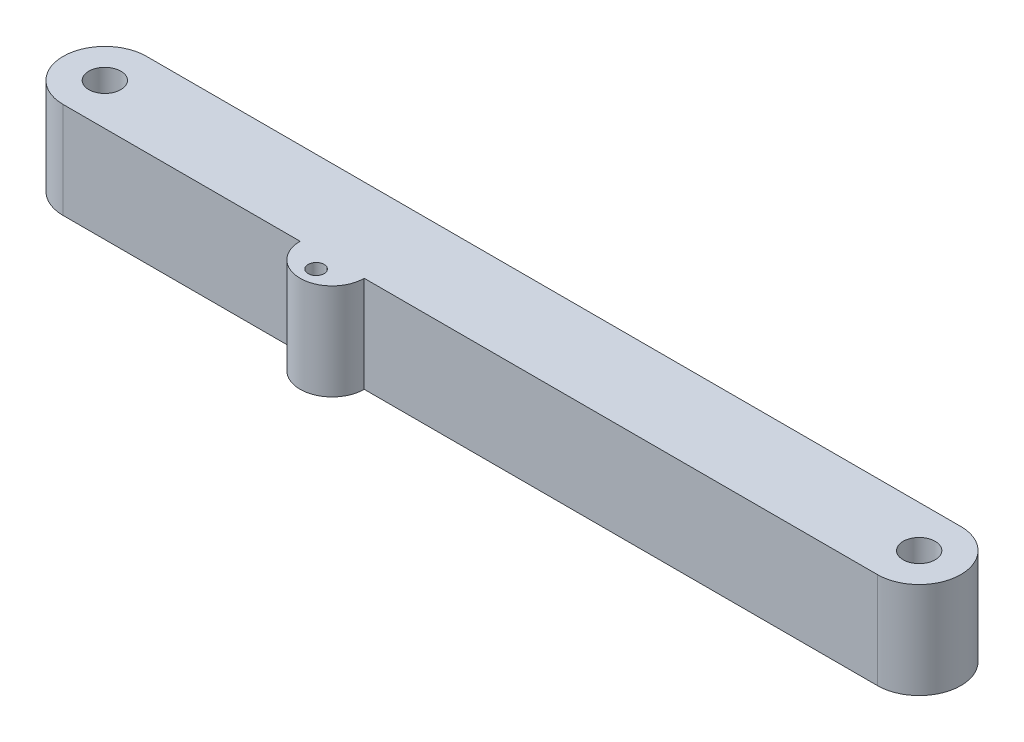
ISO-10303-21;
HEADER;
FILE_DESCRIPTION(('STEP AP214'),'2;1');
FILE_NAME('part.step','',(''),(''),'','','');
FILE_SCHEMA(('AUTOMOTIVE_DESIGN { 1 0 10303 214 1 1 1 1 }'));
ENDSEC;
DATA;
#1=APPLICATION_CONTEXT('core data for automotive mechanical design processes');
#2=APPLICATION_PROTOCOL_DEFINITION('international standard','automotive_design',2000,#1);
#3=PRODUCT_CONTEXT('',#1,'mechanical');
#4=PRODUCT('Part','Part','',(#3));
#5=PRODUCT_RELATED_PRODUCT_CATEGORY('part','',(#4));
#6=PRODUCT_DEFINITION_FORMATION('','',#4);
#7=PRODUCT_DEFINITION_CONTEXT('part definition',#1,'design');
#8=PRODUCT_DEFINITION('design','',#6,#7);
#9=PRODUCT_DEFINITION_SHAPE('','',#8);
#10=(LENGTH_UNIT() NAMED_UNIT(*) SI_UNIT(.MILLI.,.METRE.));
#11=(NAMED_UNIT(*) PLANE_ANGLE_UNIT() SI_UNIT($,.RADIAN.));
#12=(NAMED_UNIT(*) SI_UNIT($,.STERADIAN.) SOLID_ANGLE_UNIT());
#13=UNCERTAINTY_MEASURE_WITH_UNIT(LENGTH_MEASURE(1.E-05),#10,'distance_accuracy_value','');
#14=(GEOMETRIC_REPRESENTATION_CONTEXT(3) GLOBAL_UNCERTAINTY_ASSIGNED_CONTEXT((#13)) GLOBAL_UNIT_ASSIGNED_CONTEXT((#10,
#11,#12)) REPRESENTATION_CONTEXT('',''));
#15=CARTESIAN_POINT('',(0.,0.,0.));
#16=DIRECTION('',(0.,0.,1.));
#17=DIRECTION('',(1.,0.,0.));
#18=AXIS2_PLACEMENT_3D('',#15,#16,#17);
#19=CARTESIAN_POINT('',(-80.645,19.05,8.255));
#20=DIRECTION('',(0.,0.,-1.));
#21=DIRECTION('',(-1.,0.,0.));
#22=AXIS2_PLACEMENT_3D('',#19,#20,#21);
#23=PLANE('',#22);
#24=DIRECTION('',(1.,0.,0.));
#25=VECTOR('',#24,1.);
#26=CARTESIAN_POINT('',(-80.645,0.,8.255));
#27=LINE('',#26,#25);
#28=CARTESIAN_POINT('',(-80.645,0.,8.255));
#29=VERTEX_POINT('',#28);
#30=CARTESIAN_POINT('',(-33.713899298,0.,8.255));
#31=VERTEX_POINT('',#30);
#32=EDGE_CURVE('E97',#29,#31,#27,.T.);
#33=ORIENTED_EDGE('',*,*,#32,.T.);
#34=DIRECTION('',(0.,1.,0.));
#35=VECTOR('',#34,1.);
#36=CARTESIAN_POINT('',(-33.713899298,-14.1990316571237,8.255));
#37=LINE('',#36,#35);
#38=CARTESIAN_POINT('',(-33.713899298,19.05,8.255));
#39=VERTEX_POINT('',#38);
#40=EDGE_CURVE('E57',#31,#39,#37,.T.);
#41=ORIENTED_EDGE('',*,*,#40,.T.);
#42=DIRECTION('',(1.,0.,0.));
#43=VECTOR('',#42,1.);
#44=CARTESIAN_POINT('',(-80.645,19.05,8.255));
#45=LINE('',#44,#43);
#46=CARTESIAN_POINT('',(-80.645,19.05,8.255));
#47=VERTEX_POINT('',#46);
#48=EDGE_CURVE('E134',#47,#39,#45,.T.);
#49=ORIENTED_EDGE('',*,*,#48,.F.);
#50=DIRECTION('',(0.,-1.,0.));
#51=VECTOR('',#50,1.);
#52=CARTESIAN_POINT('',(-80.645,19.05,8.255));
#53=LINE('',#52,#51);
#54=EDGE_CURVE('E11',#47,#29,#53,.T.);
#55=ORIENTED_EDGE('',*,*,#54,.T.);
#56=EDGE_LOOP('',(#33,#41,#49,#55));
#57=FACE_BOUND('',#56,.T.);
#58=ADVANCED_FACE('F34',(#57),#23,.F.);
#59=CARTESIAN_POINT('',(-80.645,19.05,0.));
#60=DIRECTION('',(0.,1.,0.));
#61=DIRECTION('',(0.,0.,1.));
#62=AXIS2_PLACEMENT_3D('',#59,#60,#61);
#63=PLANE('',#62);
#64=CARTESIAN_POINT('',(-80.645,19.05,0.));
#65=DIRECTION('',(0.,1.,0.));
#66=DIRECTION('',(0.,0.,1.));
#67=AXIS2_PLACEMENT_3D('',#64,#65,#66);
#68=CIRCLE('',#67,3.175);
#69=CARTESIAN_POINT('',(-80.645,19.05,3.175));
#70=VERTEX_POINT('',#69);
#71=EDGE_CURVE('E125',#70,#70,#68,.T.);
#72=ORIENTED_EDGE('',*,*,#71,.F.);
#73=EDGE_LOOP('',(#72));
#74=FACE_BOUND('',#73,.T.);
#75=CARTESIAN_POINT('',(-80.645,19.05,0.));
#76=DIRECTION('',(0.,1.,0.));
#77=DIRECTION('',(0.,0.,1.));
#78=AXIS2_PLACEMENT_3D('',#75,#76,#77);
#79=CIRCLE('',#78,8.255);
#80=CARTESIAN_POINT('',(-80.645,19.05,-8.255));
#81=VERTEX_POINT('',#80);
#82=EDGE_CURVE('E130',#81,#47,#79,.T.);
#83=ORIENTED_EDGE('',*,*,#82,.T.);
#84=ORIENTED_EDGE('',*,*,#48,.T.);
#85=CARTESIAN_POINT('',(-27.363899298,19.05,8.255));
#86=DIRECTION('',(0.,1.,0.));
#87=DIRECTION('',(0.,0.,1.));
#88=AXIS2_PLACEMENT_3D('',#85,#86,#87);
#89=CIRCLE('',#88,6.35);
#90=CARTESIAN_POINT('',(-21.013899298,19.05,8.255));
#91=VERTEX_POINT('',#90);
#92=EDGE_CURVE('E105',#39,#91,#89,.T.);
#93=ORIENTED_EDGE('',*,*,#92,.T.);
#94=CARTESIAN_POINT('',(80.645,19.05,8.255));
#95=VERTEX_POINT('',#94);
#96=EDGE_CURVE('E49',#91,#95,#45,.T.);
#97=ORIENTED_EDGE('',*,*,#96,.T.);
#98=CARTESIAN_POINT('',(80.645,19.05,0.));
#99=DIRECTION('',(0.,1.,0.));
#100=DIRECTION('',(0.,0.,-1.));
#101=AXIS2_PLACEMENT_3D('',#98,#99,#100);
#102=CIRCLE('',#101,8.255);
#103=CARTESIAN_POINT('',(80.645,19.05,-8.255));
#104=VERTEX_POINT('',#103);
#105=EDGE_CURVE('E136',#95,#104,#102,.T.);
#106=ORIENTED_EDGE('',*,*,#105,.T.);
#107=DIRECTION('',(-1.,0.,0.));
#108=VECTOR('',#107,1.);
#109=CARTESIAN_POINT('',(-80.645,19.05,-8.255));
#110=LINE('',#109,#108);
#111=EDGE_CURVE('E138',#104,#81,#110,.T.);
#112=ORIENTED_EDGE('',*,*,#111,.T.);
#113=EDGE_LOOP('',(#83,#84,#93,#97,#106,#112));
#114=FACE_BOUND('',#113,.T.);
#115=CARTESIAN_POINT('',(80.645,19.05,0.));
#116=DIRECTION('',(0.,1.,0.));
#117=DIRECTION('',(0.,0.,1.));
#118=AXIS2_PLACEMENT_3D('',#115,#116,#117);
#119=CIRCLE('',#118,3.175);
#120=CARTESIAN_POINT('',(80.645,19.05,3.175));
#121=VERTEX_POINT('',#120);
#122=EDGE_CURVE('E119',#121,#121,#119,.T.);
#123=ORIENTED_EDGE('',*,*,#122,.F.);
#124=EDGE_LOOP('',(#123));
#125=FACE_BOUND('',#124,.T.);
#126=CARTESIAN_POINT('',(-27.363899298,19.05,11.43));
#127=DIRECTION('',(0.,1.,0.));
#128=DIRECTION('',(0.,0.,1.));
#129=AXIS2_PLACEMENT_3D('',#126,#127,#128);
#130=CIRCLE('',#129,1.5875);
#131=CARTESIAN_POINT('',(-27.363899298,19.05,13.0175));
#132=VERTEX_POINT('',#131);
#133=EDGE_CURVE('E115',#132,#132,#130,.T.);
#134=ORIENTED_EDGE('',*,*,#133,.F.);
#135=EDGE_LOOP('',(#134));
#136=FACE_BOUND('',#135,.T.);
#137=ADVANCED_FACE('F155',(#74,#114,#125,#136),#63,.T.);
#138=CARTESIAN_POINT('',(-80.645,0.,0.));
#139=DIRECTION('',(0.,1.,0.));
#140=DIRECTION('',(0.,0.,1.));
#141=AXIS2_PLACEMENT_3D('',#138,#139,#140);
#142=PLANE('',#141);
#143=CARTESIAN_POINT('',(-80.645,0.,0.));
#144=DIRECTION('',(0.,1.,0.));
#145=DIRECTION('',(0.,0.,1.));
#146=AXIS2_PLACEMENT_3D('',#143,#144,#145);
#147=CIRCLE('',#146,8.255);
#148=CARTESIAN_POINT('',(-80.645,0.,-8.255));
#149=VERTEX_POINT('',#148);
#150=EDGE_CURVE('E98',#149,#29,#147,.T.);
#151=ORIENTED_EDGE('',*,*,#150,.F.);
#152=DIRECTION('',(-1.,0.,0.));
#153=VECTOR('',#152,1.);
#154=CARTESIAN_POINT('',(-80.645,0.,-8.255));
#155=LINE('',#154,#153);
#156=CARTESIAN_POINT('',(80.645,0.,-8.255));
#157=VERTEX_POINT('',#156);
#158=EDGE_CURVE('E133',#157,#149,#155,.T.);
#159=ORIENTED_EDGE('',*,*,#158,.F.);
#160=CARTESIAN_POINT('',(80.645,0.,0.));
#161=DIRECTION('',(0.,1.,0.));
#162=DIRECTION('',(0.,0.,-1.));
#163=AXIS2_PLACEMENT_3D('',#160,#161,#162);
#164=CIRCLE('',#163,8.255);
#165=CARTESIAN_POINT('',(80.645,0.,8.255));
#166=VERTEX_POINT('',#165);
#167=EDGE_CURVE('E95',#166,#157,#164,.T.);
#168=ORIENTED_EDGE('',*,*,#167,.F.);
#169=CARTESIAN_POINT('',(-21.013899298,0.,8.255));
#170=VERTEX_POINT('',#169);
#171=EDGE_CURVE('E88',#170,#166,#27,.T.);
#172=ORIENTED_EDGE('',*,*,#171,.F.);
#173=CARTESIAN_POINT('',(-27.363899298,0.,8.255));
#174=DIRECTION('',(0.,1.,0.));
#175=DIRECTION('',(0.,0.,1.));
#176=AXIS2_PLACEMENT_3D('',#173,#174,#175);
#177=CIRCLE('',#176,6.35);
#178=EDGE_CURVE('E93',#170,#31,#177,.F.);
#179=ORIENTED_EDGE('',*,*,#178,.T.);
#180=ORIENTED_EDGE('',*,*,#32,.F.);
#181=EDGE_LOOP('',(#151,#159,#168,#172,#179,#180));
#182=FACE_BOUND('',#181,.T.);
#183=CARTESIAN_POINT('',(-80.645,0.,0.));
#184=DIRECTION('',(0.,1.,0.));
#185=DIRECTION('',(0.,0.,1.));
#186=AXIS2_PLACEMENT_3D('',#183,#184,#185);
#187=CIRCLE('',#186,3.175);
#188=CARTESIAN_POINT('',(-80.645,0.,3.175));
#189=VERTEX_POINT('',#188);
#190=EDGE_CURVE('E122',#189,#189,#187,.T.);
#191=ORIENTED_EDGE('',*,*,#190,.T.);
#192=EDGE_LOOP('',(#191));
#193=FACE_BOUND('',#192,.T.);
#194=CARTESIAN_POINT('',(80.645,0.,0.));
#195=DIRECTION('',(0.,1.,0.));
#196=DIRECTION('',(0.,0.,1.));
#197=AXIS2_PLACEMENT_3D('',#194,#195,#196);
#198=CIRCLE('',#197,3.175);
#199=CARTESIAN_POINT('',(80.645,0.,3.175));
#200=VERTEX_POINT('',#199);
#201=EDGE_CURVE('E111',#200,#200,#198,.T.);
#202=ORIENTED_EDGE('',*,*,#201,.T.);
#203=EDGE_LOOP('',(#202));
#204=FACE_BOUND('',#203,.T.);
#205=CARTESIAN_POINT('',(-27.363899298,0.,11.43));
#206=DIRECTION('',(0.,1.,0.));
#207=DIRECTION('',(0.,0.,1.));
#208=AXIS2_PLACEMENT_3D('',#205,#206,#207);
#209=CIRCLE('',#208,1.5875);
#210=CARTESIAN_POINT('',(-27.363899298,0.,13.0175));
#211=VERTEX_POINT('',#210);
#212=EDGE_CURVE('E108',#211,#211,#209,.F.);
#213=ORIENTED_EDGE('',*,*,#212,.F.);
#214=EDGE_LOOP('',(#213));
#215=FACE_BOUND('',#214,.T.);
#216=ADVANCED_FACE('F90',(#182,#193,#204,#215),#142,.F.);
#217=CARTESIAN_POINT('',(-80.645,19.05,0.));
#218=DIRECTION('',(0.,-1.,0.));
#219=DIRECTION('',(0.,0.,-1.));
#220=AXIS2_PLACEMENT_3D('',#217,#218,#219);
#221=CYLINDRICAL_SURFACE('',#220,8.255);
#222=ORIENTED_EDGE('',*,*,#150,.T.);
#223=ORIENTED_EDGE('',*,*,#54,.F.);
#224=ORIENTED_EDGE('',*,*,#82,.F.);
#225=DIRECTION('',(0.,-1.,0.));
#226=VECTOR('',#225,1.);
#227=CARTESIAN_POINT('',(-80.645,19.05,-8.255));
#228=LINE('',#227,#226);
#229=EDGE_CURVE('E140',#81,#149,#228,.T.);
#230=ORIENTED_EDGE('',*,*,#229,.T.);
#231=EDGE_LOOP('',(#222,#223,#224,#230));
#232=FACE_BOUND('',#231,.T.);
#233=ADVANCED_FACE('F36',(#232),#221,.T.);
#234=ORIENTED_EDGE('',*,*,#96,.F.);
#235=DIRECTION('',(0.,1.,0.));
#236=VECTOR('',#235,1.);
#237=CARTESIAN_POINT('',(-21.013899298,-14.1990316571237,8.255));
#238=LINE('',#237,#236);
#239=EDGE_CURVE('E100',#170,#91,#238,.T.);
#240=ORIENTED_EDGE('',*,*,#239,.F.);
#241=ORIENTED_EDGE('',*,*,#171,.T.);
#242=DIRECTION('',(0.,-1.,0.));
#243=VECTOR('',#242,1.);
#244=CARTESIAN_POINT('',(80.645,19.05,8.255));
#245=LINE('',#244,#243);
#246=EDGE_CURVE('E42',#95,#166,#245,.T.);
#247=ORIENTED_EDGE('',*,*,#246,.F.);
#248=EDGE_LOOP('',(#234,#240,#241,#247));
#249=FACE_BOUND('',#248,.T.);
#250=ADVANCED_FACE('F101',(#249),#23,.F.);
#251=CARTESIAN_POINT('',(80.645,19.05,0.));
#252=DIRECTION('',(0.,-1.,0.));
#253=DIRECTION('',(0.,0.,-1.));
#254=AXIS2_PLACEMENT_3D('',#251,#252,#253);
#255=CYLINDRICAL_SURFACE('',#254,8.255);
#256=ORIENTED_EDGE('',*,*,#167,.T.);
#257=DIRECTION('',(0.,-1.,0.));
#258=VECTOR('',#257,1.);
#259=CARTESIAN_POINT('',(80.645,19.05,-8.255));
#260=LINE('',#259,#258);
#261=EDGE_CURVE('E147',#104,#157,#260,.T.);
#262=ORIENTED_EDGE('',*,*,#261,.F.);
#263=ORIENTED_EDGE('',*,*,#105,.F.);
#264=ORIENTED_EDGE('',*,*,#246,.T.);
#265=EDGE_LOOP('',(#256,#262,#263,#264));
#266=FACE_BOUND('',#265,.T.);
#267=ADVANCED_FACE('F151',(#266),#255,.T.);
#268=CARTESIAN_POINT('',(-80.645,19.05,-8.255));
#269=DIRECTION('',(0.,0.,1.));
#270=DIRECTION('',(1.,0.,0.));
#271=AXIS2_PLACEMENT_3D('',#268,#269,#270);
#272=PLANE('',#271);
#273=ORIENTED_EDGE('',*,*,#158,.T.);
#274=ORIENTED_EDGE('',*,*,#229,.F.);
#275=ORIENTED_EDGE('',*,*,#111,.F.);
#276=ORIENTED_EDGE('',*,*,#261,.T.);
#277=EDGE_LOOP('',(#273,#274,#275,#276));
#278=FACE_BOUND('',#277,.T.);
#279=ADVANCED_FACE('F162',(#278),#272,.F.);
#280=CARTESIAN_POINT('',(-80.645,19.05,0.));
#281=DIRECTION('',(0.,-1.,0.));
#282=DIRECTION('',(0.,0.,-1.));
#283=AXIS2_PLACEMENT_3D('',#280,#281,#282);
#284=CYLINDRICAL_SURFACE('',#283,3.175);
#285=ORIENTED_EDGE('',*,*,#71,.T.);
#286=EDGE_LOOP('',(#285));
#287=FACE_BOUND('',#286,.T.);
#288=ORIENTED_EDGE('',*,*,#190,.F.);
#289=EDGE_LOOP('',(#288));
#290=FACE_BOUND('',#289,.T.);
#291=ADVANCED_FACE('F164',(#287,#290),#284,.F.);
#292=CARTESIAN_POINT('',(80.645,19.05,0.));
#293=DIRECTION('',(0.,-1.,0.));
#294=DIRECTION('',(0.,0.,-1.));
#295=AXIS2_PLACEMENT_3D('',#292,#293,#294);
#296=CYLINDRICAL_SURFACE('',#295,3.175);
#297=ORIENTED_EDGE('',*,*,#122,.T.);
#298=EDGE_LOOP('',(#297));
#299=FACE_BOUND('',#298,.T.);
#300=ORIENTED_EDGE('',*,*,#201,.F.);
#301=EDGE_LOOP('',(#300));
#302=FACE_BOUND('',#301,.T.);
#303=ADVANCED_FACE('F170',(#299,#302),#296,.F.);
#304=CARTESIAN_POINT('',(-27.363899298,-14.1990316571237,11.43));
#305=DIRECTION('',(0.,1.,0.));
#306=DIRECTION('',(0.,0.,1.));
#307=AXIS2_PLACEMENT_3D('',#304,#305,#306);
#308=CYLINDRICAL_SURFACE('',#307,1.5875);
#309=ORIENTED_EDGE('',*,*,#212,.T.);
#310=EDGE_LOOP('',(#309));
#311=FACE_BOUND('',#310,.T.);
#312=ORIENTED_EDGE('',*,*,#133,.T.);
#313=EDGE_LOOP('',(#312));
#314=FACE_BOUND('',#313,.T.);
#315=ADVANCED_FACE('F193',(#311,#314),#308,.F.);
#316=CARTESIAN_POINT('',(-27.363899298,-14.1990316571237,8.255));
#317=DIRECTION('',(0.,1.,0.));
#318=DIRECTION('',(0.,0.,1.));
#319=AXIS2_PLACEMENT_3D('',#316,#317,#318);
#320=CYLINDRICAL_SURFACE('',#319,6.35);
#321=ORIENTED_EDGE('',*,*,#178,.F.);
#322=ORIENTED_EDGE('',*,*,#239,.T.);
#323=ORIENTED_EDGE('',*,*,#92,.F.);
#324=ORIENTED_EDGE('',*,*,#40,.F.);
#325=EDGE_LOOP('',(#321,#322,#323,#324));
#326=FACE_BOUND('',#325,.T.);
#327=ADVANCED_FACE('F107',(#326),#320,.T.);
#328=CLOSED_SHELL('',(#58,#137,#216,#233,#250,#267,#279,#291,#303,#315,#327));
#329=MANIFOLD_SOLID_BREP('B2',#328);
#330=ADVANCED_BREP_SHAPE_REPRESENTATION('',(#18,#329),#14);
#331=SHAPE_DEFINITION_REPRESENTATION(#9,#330);
ENDSEC;
END-ISO-10303-21;
